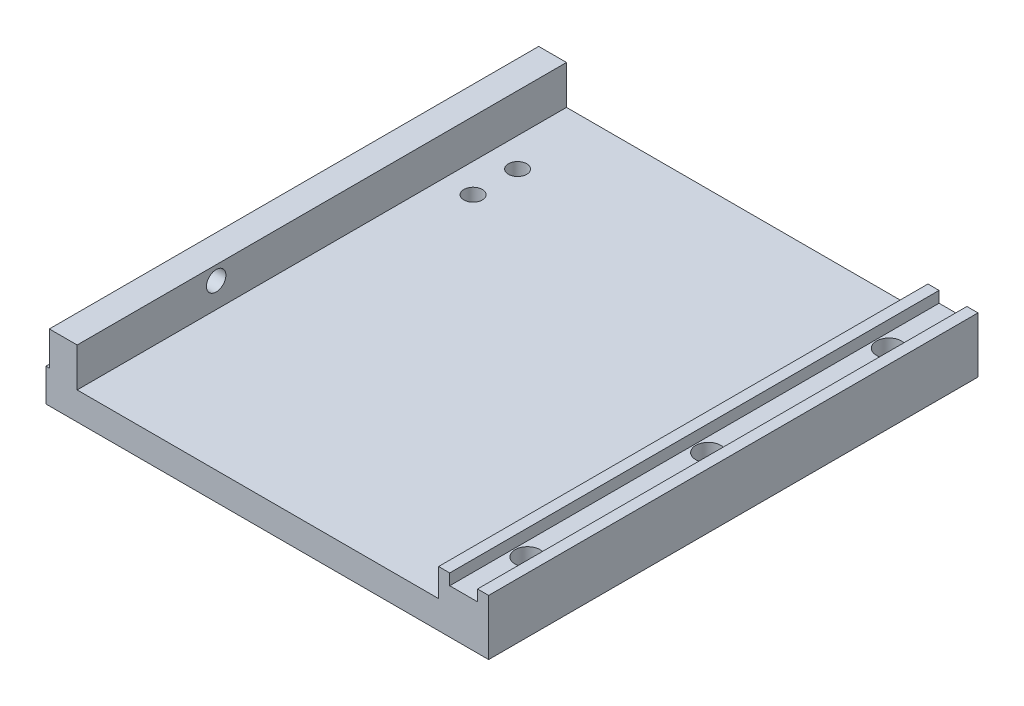
ISO-10303-21;
HEADER;
FILE_DESCRIPTION(('STEP AP214'),'2;1');
FILE_NAME('part.step','',(''),(''),'','','');
FILE_SCHEMA(('AUTOMOTIVE_DESIGN { 1 0 10303 214 1 1 1 1 }'));
ENDSEC;
DATA;
#1=APPLICATION_CONTEXT('core data for automotive mechanical design processes');
#2=APPLICATION_PROTOCOL_DEFINITION('international standard','automotive_design',2000,#1);
#3=PRODUCT_CONTEXT('',#1,'mechanical');
#4=PRODUCT('Part','Part','',(#3));
#5=PRODUCT_RELATED_PRODUCT_CATEGORY('part','',(#4));
#6=PRODUCT_DEFINITION_FORMATION('','',#4);
#7=PRODUCT_DEFINITION_CONTEXT('part definition',#1,'design');
#8=PRODUCT_DEFINITION('design','',#6,#7);
#9=PRODUCT_DEFINITION_SHAPE('','',#8);
#10=(LENGTH_UNIT() NAMED_UNIT(*) SI_UNIT(.MILLI.,.METRE.));
#11=(NAMED_UNIT(*) PLANE_ANGLE_UNIT() SI_UNIT($,.RADIAN.));
#12=(NAMED_UNIT(*) SI_UNIT($,.STERADIAN.) SOLID_ANGLE_UNIT());
#13=UNCERTAINTY_MEASURE_WITH_UNIT(LENGTH_MEASURE(1.E-05),#10,'distance_accuracy_value','');
#14=(GEOMETRIC_REPRESENTATION_CONTEXT(3) GLOBAL_UNCERTAINTY_ASSIGNED_CONTEXT((#13)) GLOBAL_UNIT_ASSIGNED_CONTEXT((#10,
#11,#12)) REPRESENTATION_CONTEXT('',''));
#15=CARTESIAN_POINT('',(0.,0.,0.));
#16=DIRECTION('',(0.,0.,1.));
#17=DIRECTION('',(1.,0.,0.));
#18=AXIS2_PLACEMENT_3D('',#15,#16,#17);
#19=CARTESIAN_POINT('',(-8.9999999999999,10.,88.));
#20=DIRECTION('',(0.,-1.,0.));
#21=DIRECTION('',(0.,0.,-1.));
#22=AXIS2_PLACEMENT_3D('',#19,#20,#21);
#23=PLANE('',#22);
#24=DIRECTION('',(-1.,0.,0.));
#25=VECTOR('',#24,1.);
#26=CARTESIAN_POINT('',(-8.9999999999999,10.,0.));
#27=LINE('',#26,#25);
#28=CARTESIAN_POINT('',(-7.00000000000012,10.,0.));
#29=VERTEX_POINT('',#28);
#30=CARTESIAN_POINT('',(-8.9999999999999,10.,0.));
#31=VERTEX_POINT('',#30);
#32=EDGE_CURVE('E176',#29,#31,#27,.T.);
#33=ORIENTED_EDGE('',*,*,#32,.T.);
#34=DIRECTION('',(0.,0.,-1.));
#35=VECTOR('',#34,1.);
#36=CARTESIAN_POINT('',(-8.9999999999999,10.,88.));
#37=LINE('',#36,#35);
#38=CARTESIAN_POINT('',(-8.9999999999999,10.,88.));
#39=VERTEX_POINT('',#38);
#40=EDGE_CURVE('E11',#39,#31,#37,.T.);
#41=ORIENTED_EDGE('',*,*,#40,.F.);
#42=DIRECTION('',(-1.,0.,0.));
#43=VECTOR('',#42,1.);
#44=CARTESIAN_POINT('',(-8.9999999999999,10.,88.));
#45=LINE('',#44,#43);
#46=CARTESIAN_POINT('',(-7.00000000000012,10.,88.));
#47=VERTEX_POINT('',#46);
#48=EDGE_CURVE('E203',#47,#39,#45,.T.);
#49=ORIENTED_EDGE('',*,*,#48,.F.);
#50=DIRECTION('',(0.,0.,-1.));
#51=VECTOR('',#50,1.);
#52=CARTESIAN_POINT('',(-7.00000000000012,10.,88.));
#53=LINE('',#52,#51);
#54=EDGE_CURVE('E172',#47,#29,#53,.T.);
#55=ORIENTED_EDGE('',*,*,#54,.T.);
#56=EDGE_LOOP('',(#33,#41,#49,#55));
#57=FACE_BOUND('',#56,.T.);
#58=ADVANCED_FACE('F39',(#57),#23,.F.);
#59=CARTESIAN_POINT('',(-8.9999999999999,10.,88.));
#60=DIRECTION('',(1.,0.,0.));
#61=DIRECTION('',(0.,0.,-1.));
#62=AXIS2_PLACEMENT_3D('',#59,#60,#61);
#63=PLANE('',#62);
#64=DIRECTION('',(0.,-1.,0.));
#65=VECTOR('',#64,1.);
#66=CARTESIAN_POINT('',(-8.9999999999999,10.,0.));
#67=LINE('',#66,#65);
#68=CARTESIAN_POINT('',(-8.9999999999999,5.,0.));
#69=VERTEX_POINT('',#68);
#70=EDGE_CURVE('E179',#31,#69,#67,.T.);
#71=ORIENTED_EDGE('',*,*,#70,.T.);
#72=DIRECTION('',(0.,0.,-1.));
#73=VECTOR('',#72,1.);
#74=CARTESIAN_POINT('',(-8.9999999999999,5.,88.));
#75=LINE('',#74,#73);
#76=CARTESIAN_POINT('',(-8.9999999999999,5.,88.));
#77=VERTEX_POINT('',#76);
#78=EDGE_CURVE('E48',#77,#69,#75,.T.);
#79=ORIENTED_EDGE('',*,*,#78,.F.);
#80=DIRECTION('',(0.,-1.,0.));
#81=VECTOR('',#80,1.);
#82=CARTESIAN_POINT('',(-8.9999999999999,10.,88.));
#83=LINE('',#82,#81);
#84=EDGE_CURVE('E119',#39,#77,#83,.T.);
#85=ORIENTED_EDGE('',*,*,#84,.F.);
#86=ORIENTED_EDGE('',*,*,#40,.T.);
#87=EDGE_LOOP('',(#71,#79,#85,#86));
#88=FACE_BOUND('',#87,.T.);
#89=ADVANCED_FACE('F305',(#88),#63,.F.);
#90=CARTESIAN_POINT('',(-8.9999999999999,5.,88.));
#91=DIRECTION('',(0.,-1.,0.));
#92=DIRECTION('',(0.,0.,-1.));
#93=AXIS2_PLACEMENT_3D('',#90,#91,#92);
#94=PLANE('',#93);
#95=CARTESIAN_POINT('',(-68.8,5.,14.));
#96=DIRECTION('',(0.,-1.,0.));
#97=DIRECTION('',(0.,0.,-1.));
#98=AXIS2_PLACEMENT_3D('',#95,#96,#97);
#99=CIRCLE('',#98,1.65);
#100=CARTESIAN_POINT('',(-68.8,5.,12.35));
#101=VERTEX_POINT('',#100);
#102=EDGE_CURVE('E617',#101,#101,#99,.T.);
#103=ORIENTED_EDGE('',*,*,#102,.T.);
#104=EDGE_LOOP('',(#103));
#105=FACE_BOUND('',#104,.T.);
#106=CARTESIAN_POINT('',(-68.8,5.,22.));
#107=DIRECTION('',(0.,-1.,0.));
#108=DIRECTION('',(0.,0.,-1.));
#109=AXIS2_PLACEMENT_3D('',#106,#107,#108);
#110=CIRCLE('',#109,1.65);
#111=CARTESIAN_POINT('',(-68.8,5.,20.35));
#112=VERTEX_POINT('',#111);
#113=EDGE_CURVE('E623',#112,#112,#110,.T.);
#114=ORIENTED_EDGE('',*,*,#113,.T.);
#115=EDGE_LOOP('',(#114));
#116=FACE_BOUND('',#115,.T.);
#117=DIRECTION('',(-1.,0.,0.));
#118=VECTOR('',#117,1.);
#119=CARTESIAN_POINT('',(-8.9999999999999,5.,0.));
#120=LINE('',#119,#118);
#121=CARTESIAN_POINT('',(-74.0000000000001,5.,0.));
#122=VERTEX_POINT('',#121);
#123=EDGE_CURVE('E182',#69,#122,#120,.T.);
#124=ORIENTED_EDGE('',*,*,#123,.T.);
#125=DIRECTION('',(0.,0.,-1.));
#126=VECTOR('',#125,1.);
#127=CARTESIAN_POINT('',(-74.0000000000001,5.,88.));
#128=LINE('',#127,#126);
#129=CARTESIAN_POINT('',(-74.0000000000001,5.,88.));
#130=VERTEX_POINT('',#129);
#131=EDGE_CURVE('E228',#130,#122,#128,.T.);
#132=ORIENTED_EDGE('',*,*,#131,.F.);
#133=DIRECTION('',(-1.,0.,0.));
#134=VECTOR('',#133,1.);
#135=CARTESIAN_POINT('',(-8.9999999999999,5.,88.));
#136=LINE('',#135,#134);
#137=EDGE_CURVE('E260',#77,#130,#136,.T.);
#138=ORIENTED_EDGE('',*,*,#137,.F.);
#139=ORIENTED_EDGE('',*,*,#78,.T.);
#140=EDGE_LOOP('',(#124,#132,#138,#139));
#141=FACE_BOUND('',#140,.T.);
#142=ADVANCED_FACE('F309',(#105,#116,#141),#94,.F.);
#143=CARTESIAN_POINT('',(-74.0000000000001,12.,88.));
#144=DIRECTION('',(-1.,0.,0.));
#145=DIRECTION('',(0.,0.,1.));
#146=AXIS2_PLACEMENT_3D('',#143,#144,#145);
#147=PLANE('',#146);
#148=CARTESIAN_POINT('',(-74.0000000000001,9.50000000000001,63.));
#149=DIRECTION('',(-1.,0.,0.));
#150=DIRECTION('',(0.,0.,1.));
#151=AXIS2_PLACEMENT_3D('',#148,#149,#150);
#152=CIRCLE('',#151,1.75);
#153=CARTESIAN_POINT('',(-74.0000000000001,9.50000000000001,64.75));
#154=VERTEX_POINT('',#153);
#155=EDGE_CURVE('E589',#154,#154,#152,.T.);
#156=ORIENTED_EDGE('',*,*,#155,.T.);
#157=EDGE_LOOP('',(#156));
#158=FACE_BOUND('',#157,.T.);
#159=DIRECTION('',(0.,1.,0.));
#160=VECTOR('',#159,1.);
#161=CARTESIAN_POINT('',(-74.0000000000001,12.,0.));
#162=LINE('',#161,#160);
#163=CARTESIAN_POINT('',(-74.0000000000001,12.,0.));
#164=VERTEX_POINT('',#163);
#165=EDGE_CURVE('E184',#122,#164,#162,.T.);
#166=ORIENTED_EDGE('',*,*,#165,.T.);
#167=DIRECTION('',(0.,0.,-1.));
#168=VECTOR('',#167,1.);
#169=CARTESIAN_POINT('',(-74.0000000000001,12.,88.));
#170=LINE('',#169,#168);
#171=CARTESIAN_POINT('',(-74.0000000000001,12.,88.));
#172=VERTEX_POINT('',#171);
#173=EDGE_CURVE('E225',#172,#164,#170,.T.);
#174=ORIENTED_EDGE('',*,*,#173,.F.);
#175=DIRECTION('',(0.,1.,0.));
#176=VECTOR('',#175,1.);
#177=CARTESIAN_POINT('',(-74.0000000000001,12.,88.));
#178=LINE('',#177,#176);
#179=EDGE_CURVE('E262',#130,#172,#178,.T.);
#180=ORIENTED_EDGE('',*,*,#179,.F.);
#181=ORIENTED_EDGE('',*,*,#131,.T.);
#182=EDGE_LOOP('',(#166,#174,#180,#181));
#183=FACE_BOUND('',#182,.T.);
#184=ADVANCED_FACE('F314',(#158,#183),#147,.F.);
#185=CARTESIAN_POINT('',(-74.0000000000001,12.,88.));
#186=DIRECTION('',(0.,-1.,0.));
#187=DIRECTION('',(0.,0.,-1.));
#188=AXIS2_PLACEMENT_3D('',#185,#186,#187);
#189=PLANE('',#188);
#190=DIRECTION('',(-1.,0.,0.));
#191=VECTOR('',#190,1.);
#192=CARTESIAN_POINT('',(-74.0000000000001,12.,0.));
#193=LINE('',#192,#191);
#194=CARTESIAN_POINT('',(-79.0000000000001,12.,0.));
#195=VERTEX_POINT('',#194);
#196=EDGE_CURVE('E186',#164,#195,#193,.T.);
#197=ORIENTED_EDGE('',*,*,#196,.T.);
#198=DIRECTION('',(0.,0.,-1.));
#199=VECTOR('',#198,1.);
#200=CARTESIAN_POINT('',(-79.0000000000001,12.,88.));
#201=LINE('',#200,#199);
#202=CARTESIAN_POINT('',(-79.0000000000001,12.,88.));
#203=VERTEX_POINT('',#202);
#204=EDGE_CURVE('E222',#203,#195,#201,.T.);
#205=ORIENTED_EDGE('',*,*,#204,.F.);
#206=DIRECTION('',(-1.,0.,0.));
#207=VECTOR('',#206,1.);
#208=CARTESIAN_POINT('',(-74.0000000000001,12.,88.));
#209=LINE('',#208,#207);
#210=EDGE_CURVE('E264',#172,#203,#209,.T.);
#211=ORIENTED_EDGE('',*,*,#210,.F.);
#212=ORIENTED_EDGE('',*,*,#173,.T.);
#213=EDGE_LOOP('',(#197,#205,#211,#212));
#214=FACE_BOUND('',#213,.T.);
#215=ADVANCED_FACE('F320',(#214),#189,.F.);
#216=CARTESIAN_POINT('',(-79.0000000000001,5.89999999999963,88.));
#217=DIRECTION('',(1.,0.,0.));
#218=DIRECTION('',(0.,0.,-1.));
#219=AXIS2_PLACEMENT_3D('',#216,#217,#218);
#220=PLANE('',#219);
#221=CARTESIAN_POINT('',(-79.0000000000001,9.50000000000001,63.));
#222=DIRECTION('',(-1.,0.,0.));
#223=DIRECTION('',(0.,0.,1.));
#224=AXIS2_PLACEMENT_3D('',#221,#222,#223);
#225=CIRCLE('',#224,1.75);
#226=CARTESIAN_POINT('',(-79.0000000000001,9.50000000000001,64.75));
#227=VERTEX_POINT('',#226);
#228=EDGE_CURVE('E592',#227,#227,#225,.T.);
#229=ORIENTED_EDGE('',*,*,#228,.F.);
#230=EDGE_LOOP('',(#229));
#231=FACE_BOUND('',#230,.T.);
#232=DIRECTION('',(0.,-1.,0.));
#233=VECTOR('',#232,1.);
#234=CARTESIAN_POINT('',(-79.0000000000001,5.89999999999963,0.));
#235=LINE('',#234,#233);
#236=CARTESIAN_POINT('',(-79.0000000000001,5.89999999999963,0.));
#237=VERTEX_POINT('',#236);
#238=EDGE_CURVE('E188',#195,#237,#235,.T.);
#239=ORIENTED_EDGE('',*,*,#238,.T.);
#240=DIRECTION('',(0.,0.,-1.));
#241=VECTOR('',#240,1.);
#242=CARTESIAN_POINT('',(-79.0000000000001,5.89999999999963,88.));
#243=LINE('',#242,#241);
#244=CARTESIAN_POINT('',(-79.0000000000001,5.89999999999963,88.));
#245=VERTEX_POINT('',#244);
#246=EDGE_CURVE('E219',#245,#237,#243,.T.);
#247=ORIENTED_EDGE('',*,*,#246,.F.);
#248=DIRECTION('',(0.,-1.,0.));
#249=VECTOR('',#248,1.);
#250=CARTESIAN_POINT('',(-79.0000000000001,5.89999999999963,88.));
#251=LINE('',#250,#249);
#252=EDGE_CURVE('E266',#203,#245,#251,.T.);
#253=ORIENTED_EDGE('',*,*,#252,.F.);
#254=ORIENTED_EDGE('',*,*,#204,.T.);
#255=EDGE_LOOP('',(#239,#247,#253,#254));
#256=FACE_BOUND('',#255,.T.);
#257=ADVANCED_FACE('F324',(#231,#256),#220,.F.);
#258=CARTESIAN_POINT('',(-79.5999999999986,5.89999999999963,88.));
#259=DIRECTION('',(0.,-1.,0.));
#260=DIRECTION('',(0.,0.,-1.));
#261=AXIS2_PLACEMENT_3D('',#258,#259,#260);
#262=PLANE('',#261);
#263=DIRECTION('',(-1.,0.,0.));
#264=VECTOR('',#263,1.);
#265=CARTESIAN_POINT('',(-79.5999999999986,5.89999999999963,0.));
#266=LINE('',#265,#264);
#267=CARTESIAN_POINT('',(-79.5999999999986,5.89999999999963,0.));
#268=VERTEX_POINT('',#267);
#269=EDGE_CURVE('E190',#237,#268,#266,.T.);
#270=ORIENTED_EDGE('',*,*,#269,.T.);
#271=DIRECTION('',(0.,0.,-1.));
#272=VECTOR('',#271,1.);
#273=CARTESIAN_POINT('',(-79.5999999999986,5.89999999999963,88.));
#274=LINE('',#273,#272);
#275=CARTESIAN_POINT('',(-79.5999999999986,5.89999999999963,88.));
#276=VERTEX_POINT('',#275);
#277=EDGE_CURVE('E216',#276,#268,#274,.T.);
#278=ORIENTED_EDGE('',*,*,#277,.F.);
#279=DIRECTION('',(-1.,0.,0.));
#280=VECTOR('',#279,1.);
#281=CARTESIAN_POINT('',(-79.5999999999986,5.89999999999963,88.));
#282=LINE('',#281,#280);
#283=EDGE_CURVE('E268',#245,#276,#282,.T.);
#284=ORIENTED_EDGE('',*,*,#283,.F.);
#285=ORIENTED_EDGE('',*,*,#246,.T.);
#286=EDGE_LOOP('',(#270,#278,#284,#285));
#287=FACE_BOUND('',#286,.T.);
#288=ADVANCED_FACE('F328',(#287),#262,.F.);
#289=CARTESIAN_POINT('',(-79.5999999999986,0.,88.));
#290=DIRECTION('',(1.,0.,0.));
#291=DIRECTION('',(0.,0.,-1.));
#292=AXIS2_PLACEMENT_3D('',#289,#290,#291);
#293=PLANE('',#292);
#294=CARTESIAN_POINT('',(-79.5999999999986,3.,11.5));
#295=DIRECTION('',(-1.,0.,0.));
#296=DIRECTION('',(0.,0.,1.));
#297=AXIS2_PLACEMENT_3D('',#294,#295,#296);
#298=CIRCLE('',#297,1.24999999999999);
#299=CARTESIAN_POINT('',(-79.5999999999986,3.,12.75));
#300=VERTEX_POINT('',#299);
#301=EDGE_CURVE('E594',#300,#300,#298,.T.);
#302=ORIENTED_EDGE('',*,*,#301,.F.);
#303=EDGE_LOOP('',(#302));
#304=FACE_BOUND('',#303,.T.);
#305=CARTESIAN_POINT('',(-79.5999999999986,3.,44.));
#306=DIRECTION('',(-1.,0.,0.));
#307=DIRECTION('',(0.,0.,1.));
#308=AXIS2_PLACEMENT_3D('',#305,#306,#307);
#309=CIRCLE('',#308,1.24999999999999);
#310=CARTESIAN_POINT('',(-79.5999999999986,3.,45.25));
#311=VERTEX_POINT('',#310);
#312=EDGE_CURVE('E602',#311,#311,#309,.T.);
#313=ORIENTED_EDGE('',*,*,#312,.F.);
#314=EDGE_LOOP('',(#313));
#315=FACE_BOUND('',#314,.T.);
#316=CARTESIAN_POINT('',(-79.5999999999986,3.00000000000001,76.5));
#317=DIRECTION('',(-1.,0.,0.));
#318=DIRECTION('',(0.,0.,1.));
#319=AXIS2_PLACEMENT_3D('',#316,#317,#318);
#320=CIRCLE('',#319,1.24999999999999);
#321=CARTESIAN_POINT('',(-79.5999999999986,3.00000000000001,77.75));
#322=VERTEX_POINT('',#321);
#323=EDGE_CURVE('E608',#322,#322,#320,.T.);
#324=ORIENTED_EDGE('',*,*,#323,.F.);
#325=EDGE_LOOP('',(#324));
#326=FACE_BOUND('',#325,.T.);
#327=DIRECTION('',(0.,-1.,0.));
#328=VECTOR('',#327,1.);
#329=CARTESIAN_POINT('',(-79.5999999999986,0.,0.));
#330=LINE('',#329,#328);
#331=CARTESIAN_POINT('',(-79.5999999999986,0.,0.));
#332=VERTEX_POINT('',#331);
#333=EDGE_CURVE('E192',#268,#332,#330,.T.);
#334=ORIENTED_EDGE('',*,*,#333,.T.);
#335=DIRECTION('',(0.,0.,-1.));
#336=VECTOR('',#335,1.);
#337=CARTESIAN_POINT('',(-79.5999999999986,0.,88.));
#338=LINE('',#337,#336);
#339=CARTESIAN_POINT('',(-79.5999999999986,0.,88.));
#340=VERTEX_POINT('',#339);
#341=EDGE_CURVE('E213',#340,#332,#338,.T.);
#342=ORIENTED_EDGE('',*,*,#341,.F.);
#343=DIRECTION('',(0.,-1.,0.));
#344=VECTOR('',#343,1.);
#345=CARTESIAN_POINT('',(-79.5999999999986,0.,88.));
#346=LINE('',#345,#344);
#347=EDGE_CURVE('E270',#276,#340,#346,.T.);
#348=ORIENTED_EDGE('',*,*,#347,.F.);
#349=ORIENTED_EDGE('',*,*,#277,.T.);
#350=EDGE_LOOP('',(#334,#342,#348,#349));
#351=FACE_BOUND('',#350,.T.);
#352=ADVANCED_FACE('F332',(#304,#315,#326,#351),#293,.F.);
#353=CARTESIAN_POINT('',(0.,0.,88.));
#354=DIRECTION('',(0.,1.,0.));
#355=DIRECTION('',(0.,0.,1.));
#356=AXIS2_PLACEMENT_3D('',#353,#354,#355);
#357=PLANE('',#356);
#358=CARTESIAN_POINT('',(-68.8,0.,14.));
#359=DIRECTION('',(0.,-1.,0.));
#360=DIRECTION('',(0.,0.,-1.));
#361=AXIS2_PLACEMENT_3D('',#358,#359,#360);
#362=CIRCLE('',#361,1.65);
#363=CARTESIAN_POINT('',(-68.8,0.,12.35));
#364=VERTEX_POINT('',#363);
#365=EDGE_CURVE('E614',#364,#364,#362,.T.);
#366=ORIENTED_EDGE('',*,*,#365,.F.);
#367=EDGE_LOOP('',(#366));
#368=FACE_BOUND('',#367,.T.);
#369=CARTESIAN_POINT('',(-68.8,0.,22.));
#370=DIRECTION('',(0.,-1.,0.));
#371=DIRECTION('',(0.,0.,-1.));
#372=AXIS2_PLACEMENT_3D('',#369,#370,#371);
#373=CIRCLE('',#372,1.65);
#374=CARTESIAN_POINT('',(-68.8,0.,20.35));
#375=VERTEX_POINT('',#374);
#376=EDGE_CURVE('E620',#375,#375,#373,.T.);
#377=ORIENTED_EDGE('',*,*,#376,.F.);
#378=EDGE_LOOP('',(#377));
#379=FACE_BOUND('',#378,.T.);
#380=CARTESIAN_POINT('',(-4.5,0.,11.5));
#381=DIRECTION('',(0.,-1.,0.));
#382=DIRECTION('',(0.,0.,-1.));
#383=AXIS2_PLACEMENT_3D('',#380,#381,#382);
#384=CIRCLE('',#383,3.99999999999999);
#385=CARTESIAN_POINT('',(-4.5,0.,7.5));
#386=VERTEX_POINT('',#385);
#387=EDGE_CURVE('E626',#386,#386,#384,.T.);
#388=ORIENTED_EDGE('',*,*,#387,.F.);
#389=EDGE_LOOP('',(#388));
#390=FACE_BOUND('',#389,.T.);
#391=CARTESIAN_POINT('',(-4.50000000000001,0.,44.));
#392=DIRECTION('',(0.,-1.,0.));
#393=DIRECTION('',(0.,0.,-1.));
#394=AXIS2_PLACEMENT_3D('',#391,#392,#393);
#395=CIRCLE('',#394,3.99999999999999);
#396=CARTESIAN_POINT('',(-4.50000000000001,0.,40.));
#397=VERTEX_POINT('',#396);
#398=EDGE_CURVE('E250',#397,#397,#395,.T.);
#399=ORIENTED_EDGE('',*,*,#398,.F.);
#400=EDGE_LOOP('',(#399));
#401=FACE_BOUND('',#400,.T.);
#402=CARTESIAN_POINT('',(-4.50000000000001,0.,76.5));
#403=DIRECTION('',(0.,-1.,0.));
#404=DIRECTION('',(0.,0.,-1.));
#405=AXIS2_PLACEMENT_3D('',#402,#403,#404);
#406=CIRCLE('',#405,3.99999999999999);
#407=CARTESIAN_POINT('',(-4.50000000000001,0.,72.5));
#408=VERTEX_POINT('',#407);
#409=EDGE_CURVE('E237',#408,#408,#406,.T.);
#410=ORIENTED_EDGE('',*,*,#409,.F.);
#411=EDGE_LOOP('',(#410));
#412=FACE_BOUND('',#411,.T.);
#413=DIRECTION('',(1.,0.,0.));
#414=VECTOR('',#413,1.);
#415=CARTESIAN_POINT('',(0.,0.,0.));
#416=LINE('',#415,#414);
#417=CARTESIAN_POINT('',(0.,0.,0.));
#418=VERTEX_POINT('',#417);
#419=EDGE_CURVE('E194',#332,#418,#416,.T.);
#420=ORIENTED_EDGE('',*,*,#419,.T.);
#421=DIRECTION('',(0.,0.,-1.));
#422=VECTOR('',#421,1.);
#423=CARTESIAN_POINT('',(0.,0.,88.));
#424=LINE('',#423,#422);
#425=CARTESIAN_POINT('',(0.,0.,88.));
#426=VERTEX_POINT('',#425);
#427=EDGE_CURVE('E210',#426,#418,#424,.T.);
#428=ORIENTED_EDGE('',*,*,#427,.F.);
#429=DIRECTION('',(1.,0.,0.));
#430=VECTOR('',#429,1.);
#431=CARTESIAN_POINT('',(0.,0.,88.));
#432=LINE('',#431,#430);
#433=EDGE_CURVE('E272',#340,#426,#432,.T.);
#434=ORIENTED_EDGE('',*,*,#433,.F.);
#435=ORIENTED_EDGE('',*,*,#341,.T.);
#436=EDGE_LOOP('',(#420,#428,#434,#435));
#437=FACE_BOUND('',#436,.T.);
#438=ADVANCED_FACE('F336',(#368,#379,#390,#401,#412,#437),#357,.F.);
#439=CARTESIAN_POINT('',(0.,10.,88.));
#440=DIRECTION('',(-1.,0.,0.));
#441=DIRECTION('',(0.,0.,1.));
#442=AXIS2_PLACEMENT_3D('',#439,#440,#441);
#443=PLANE('',#442);
#444=DIRECTION('',(0.,1.,0.));
#445=VECTOR('',#444,1.);
#446=CARTESIAN_POINT('',(0.,10.,0.));
#447=LINE('',#446,#445);
#448=CARTESIAN_POINT('',(0.,10.,0.));
#449=VERTEX_POINT('',#448);
#450=EDGE_CURVE('E196',#418,#449,#447,.T.);
#451=ORIENTED_EDGE('',*,*,#450,.T.);
#452=DIRECTION('',(0.,0.,-1.));
#453=VECTOR('',#452,1.);
#454=CARTESIAN_POINT('',(0.,10.,88.));
#455=LINE('',#454,#453);
#456=CARTESIAN_POINT('',(0.,10.,88.));
#457=VERTEX_POINT('',#456);
#458=EDGE_CURVE('E207',#457,#449,#455,.T.);
#459=ORIENTED_EDGE('',*,*,#458,.F.);
#460=DIRECTION('',(0.,1.,0.));
#461=VECTOR('',#460,1.);
#462=CARTESIAN_POINT('',(0.,10.,88.));
#463=LINE('',#462,#461);
#464=EDGE_CURVE('E274',#426,#457,#463,.T.);
#465=ORIENTED_EDGE('',*,*,#464,.F.);
#466=ORIENTED_EDGE('',*,*,#427,.T.);
#467=EDGE_LOOP('',(#451,#459,#465,#466));
#468=FACE_BOUND('',#467,.T.);
#469=ADVANCED_FACE('F280',(#468),#443,.F.);
#470=CARTESIAN_POINT('',(-2.,10.,88.));
#471=DIRECTION('',(0.,-1.,0.));
#472=DIRECTION('',(0.,0.,-1.));
#473=AXIS2_PLACEMENT_3D('',#470,#471,#472);
#474=PLANE('',#473);
#475=DIRECTION('',(-1.,0.,0.));
#476=VECTOR('',#475,1.);
#477=CARTESIAN_POINT('',(-2.,10.,0.));
#478=LINE('',#477,#476);
#479=CARTESIAN_POINT('',(-2.,10.,0.));
#480=VERTEX_POINT('',#479);
#481=EDGE_CURVE('E198',#449,#480,#478,.T.);
#482=ORIENTED_EDGE('',*,*,#481,.T.);
#483=DIRECTION('',(0.,0.,-1.));
#484=VECTOR('',#483,1.);
#485=CARTESIAN_POINT('',(-2.,10.,88.));
#486=LINE('',#485,#484);
#487=CARTESIAN_POINT('',(-2.,10.,88.));
#488=VERTEX_POINT('',#487);
#489=EDGE_CURVE('E167',#488,#480,#486,.T.);
#490=ORIENTED_EDGE('',*,*,#489,.F.);
#491=DIRECTION('',(-1.,0.,0.));
#492=VECTOR('',#491,1.);
#493=CARTESIAN_POINT('',(-2.,10.,88.));
#494=LINE('',#493,#492);
#495=EDGE_CURVE('E158',#457,#488,#494,.T.);
#496=ORIENTED_EDGE('',*,*,#495,.F.);
#497=ORIENTED_EDGE('',*,*,#458,.T.);
#498=EDGE_LOOP('',(#482,#490,#496,#497));
#499=FACE_BOUND('',#498,.T.);
#500=ADVANCED_FACE('F284',(#499),#474,.F.);
#501=CARTESIAN_POINT('',(-2.,8.00000000000001,88.));
#502=DIRECTION('',(1.,0.,0.));
#503=DIRECTION('',(0.,0.,-1.));
#504=AXIS2_PLACEMENT_3D('',#501,#502,#503);
#505=PLANE('',#504);
#506=DIRECTION('',(0.,-1.,0.));
#507=VECTOR('',#506,1.);
#508=CARTESIAN_POINT('',(-2.,8.00000000000001,0.));
#509=LINE('',#508,#507);
#510=CARTESIAN_POINT('',(-2.,8.00000000000001,0.));
#511=VERTEX_POINT('',#510);
#512=EDGE_CURVE('E166',#480,#511,#509,.T.);
#513=ORIENTED_EDGE('',*,*,#512,.T.);
#514=DIRECTION('',(0.,0.,-1.));
#515=VECTOR('',#514,1.);
#516=CARTESIAN_POINT('',(-2.,8.00000000000001,88.));
#517=LINE('',#516,#515);
#518=CARTESIAN_POINT('',(-2.,8.00000000000001,88.));
#519=VERTEX_POINT('',#518);
#520=EDGE_CURVE('E163',#519,#511,#517,.T.);
#521=ORIENTED_EDGE('',*,*,#520,.F.);
#522=DIRECTION('',(0.,-1.,0.));
#523=VECTOR('',#522,1.);
#524=CARTESIAN_POINT('',(-2.,8.00000000000001,88.));
#525=LINE('',#524,#523);
#526=EDGE_CURVE('E152',#488,#519,#525,.T.);
#527=ORIENTED_EDGE('',*,*,#526,.F.);
#528=ORIENTED_EDGE('',*,*,#489,.T.);
#529=EDGE_LOOP('',(#513,#521,#527,#528));
#530=FACE_BOUND('',#529,.T.);
#531=ADVANCED_FACE('F164',(#530),#505,.F.);
#532=CARTESIAN_POINT('',(-7.00000000000012,8.00000000000001,88.));
#533=DIRECTION('',(0.,-1.,0.));
#534=DIRECTION('',(0.,0.,-1.));
#535=AXIS2_PLACEMENT_3D('',#532,#533,#534);
#536=PLANE('',#535);
#537=CARTESIAN_POINT('',(-4.5,8.00000000000001,11.5));
#538=DIRECTION('',(0.,-1.,0.));
#539=DIRECTION('',(0.,0.,-1.));
#540=AXIS2_PLACEMENT_3D('',#537,#538,#539);
#541=CIRCLE('',#540,2.25);
#542=CARTESIAN_POINT('',(-4.5,8.00000000000001,9.25));
#543=VERTEX_POINT('',#542);
#544=EDGE_CURVE('E42',#543,#543,#541,.T.);
#545=ORIENTED_EDGE('',*,*,#544,.T.);
#546=EDGE_LOOP('',(#545));
#547=FACE_BOUND('',#546,.T.);
#548=CARTESIAN_POINT('',(-4.50000000000001,8.00000000000001,44.));
#549=DIRECTION('',(0.,-1.,0.));
#550=DIRECTION('',(0.,0.,-1.));
#551=AXIS2_PLACEMENT_3D('',#548,#549,#550);
#552=CIRCLE('',#551,2.25);
#553=CARTESIAN_POINT('',(-4.50000000000001,8.00000000000001,41.75));
#554=VERTEX_POINT('',#553);
#555=EDGE_CURVE('E235',#554,#554,#552,.T.);
#556=ORIENTED_EDGE('',*,*,#555,.T.);
#557=EDGE_LOOP('',(#556));
#558=FACE_BOUND('',#557,.T.);
#559=CARTESIAN_POINT('',(-4.50000000000001,8.00000000000001,76.5));
#560=DIRECTION('',(0.,-1.,0.));
#561=DIRECTION('',(0.,0.,-1.));
#562=AXIS2_PLACEMENT_3D('',#559,#560,#561);
#563=CIRCLE('',#562,2.25);
#564=CARTESIAN_POINT('',(-4.50000000000001,8.00000000000001,74.25));
#565=VERTEX_POINT('',#564);
#566=EDGE_CURVE('E180',#565,#565,#563,.T.);
#567=ORIENTED_EDGE('',*,*,#566,.T.);
#568=EDGE_LOOP('',(#567));
#569=FACE_BOUND('',#568,.T.);
#570=DIRECTION('',(-1.,0.,0.));
#571=VECTOR('',#570,1.);
#572=CARTESIAN_POINT('',(-7.00000000000012,8.00000000000001,0.));
#573=LINE('',#572,#571);
#574=CARTESIAN_POINT('',(-7.00000000000012,8.00000000000001,0.));
#575=VERTEX_POINT('',#574);
#576=EDGE_CURVE('E105',#511,#575,#573,.T.);
#577=ORIENTED_EDGE('',*,*,#576,.T.);
#578=DIRECTION('',(0.,0.,-1.));
#579=VECTOR('',#578,1.);
#580=CARTESIAN_POINT('',(-7.00000000000012,8.00000000000001,88.));
#581=LINE('',#580,#579);
#582=CARTESIAN_POINT('',(-7.00000000000012,8.00000000000001,88.));
#583=VERTEX_POINT('',#582);
#584=EDGE_CURVE('E168',#583,#575,#581,.T.);
#585=ORIENTED_EDGE('',*,*,#584,.F.);
#586=DIRECTION('',(-1.,0.,0.));
#587=VECTOR('',#586,1.);
#588=CARTESIAN_POINT('',(-7.00000000000012,8.00000000000001,88.));
#589=LINE('',#588,#587);
#590=EDGE_CURVE('E156',#519,#583,#589,.T.);
#591=ORIENTED_EDGE('',*,*,#590,.F.);
#592=ORIENTED_EDGE('',*,*,#520,.T.);
#593=EDGE_LOOP('',(#577,#585,#591,#592));
#594=FACE_BOUND('',#593,.T.);
#595=ADVANCED_FACE('F170',(#547,#558,#569,#594),#536,.F.);
#596=CARTESIAN_POINT('',(-7.00000000000012,10.,88.));
#597=DIRECTION('',(-1.,0.,0.));
#598=DIRECTION('',(0.,0.,1.));
#599=AXIS2_PLACEMENT_3D('',#596,#597,#598);
#600=PLANE('',#599);
#601=DIRECTION('',(0.,1.,0.));
#602=VECTOR('',#601,1.);
#603=CARTESIAN_POINT('',(-7.00000000000012,10.,0.));
#604=LINE('',#603,#602);
#605=EDGE_CURVE('E111',#575,#29,#604,.T.);
#606=ORIENTED_EDGE('',*,*,#605,.T.);
#607=ORIENTED_EDGE('',*,*,#54,.F.);
#608=DIRECTION('',(0.,1.,0.));
#609=VECTOR('',#608,1.);
#610=CARTESIAN_POINT('',(-7.00000000000012,10.,88.));
#611=LINE('',#610,#609);
#612=EDGE_CURVE('E57',#583,#47,#611,.T.);
#613=ORIENTED_EDGE('',*,*,#612,.F.);
#614=ORIENTED_EDGE('',*,*,#584,.T.);
#615=EDGE_LOOP('',(#606,#607,#613,#614));
#616=FACE_BOUND('',#615,.T.);
#617=ADVANCED_FACE('F292',(#616),#600,.F.);
#618=CARTESIAN_POINT('',(0.,0.,88.));
#619=DIRECTION('',(0.,0.,-1.));
#620=DIRECTION('',(-1.,0.,0.));
#621=AXIS2_PLACEMENT_3D('',#618,#619,#620);
#622=PLANE('',#621);
#623=ORIENTED_EDGE('',*,*,#48,.T.);
#624=ORIENTED_EDGE('',*,*,#84,.T.);
#625=ORIENTED_EDGE('',*,*,#137,.T.);
#626=ORIENTED_EDGE('',*,*,#179,.T.);
#627=ORIENTED_EDGE('',*,*,#210,.T.);
#628=ORIENTED_EDGE('',*,*,#252,.T.);
#629=ORIENTED_EDGE('',*,*,#283,.T.);
#630=ORIENTED_EDGE('',*,*,#347,.T.);
#631=ORIENTED_EDGE('',*,*,#433,.T.);
#632=ORIENTED_EDGE('',*,*,#464,.T.);
#633=ORIENTED_EDGE('',*,*,#495,.T.);
#634=ORIENTED_EDGE('',*,*,#526,.T.);
#635=ORIENTED_EDGE('',*,*,#590,.T.);
#636=ORIENTED_EDGE('',*,*,#612,.T.);
#637=EDGE_LOOP('',(#623,#624,#625,#626,#627,#628,#629,#630,#631,#632,#633,#634,#635,#636));
#638=FACE_BOUND('',#637,.T.);
#639=ADVANCED_FACE('F154',(#638),#622,.F.);
#640=CARTESIAN_POINT('',(0.,0.,0.));
#641=DIRECTION('',(0.,0.,-1.));
#642=DIRECTION('',(-1.,0.,0.));
#643=AXIS2_PLACEMENT_3D('',#640,#641,#642);
#644=PLANE('',#643);
#645=ORIENTED_EDGE('',*,*,#32,.F.);
#646=ORIENTED_EDGE('',*,*,#605,.F.);
#647=ORIENTED_EDGE('',*,*,#576,.F.);
#648=ORIENTED_EDGE('',*,*,#512,.F.);
#649=ORIENTED_EDGE('',*,*,#481,.F.);
#650=ORIENTED_EDGE('',*,*,#450,.F.);
#651=ORIENTED_EDGE('',*,*,#419,.F.);
#652=ORIENTED_EDGE('',*,*,#333,.F.);
#653=ORIENTED_EDGE('',*,*,#269,.F.);
#654=ORIENTED_EDGE('',*,*,#238,.F.);
#655=ORIENTED_EDGE('',*,*,#196,.F.);
#656=ORIENTED_EDGE('',*,*,#165,.F.);
#657=ORIENTED_EDGE('',*,*,#123,.F.);
#658=ORIENTED_EDGE('',*,*,#70,.F.);
#659=EDGE_LOOP('',(#645,#646,#647,#648,#649,#650,#651,#652,#653,#654,#655,#656,#657,#658));
#660=FACE_BOUND('',#659,.T.);
#661=ADVANCED_FACE('F287',(#660),#644,.T.);
#662=CARTESIAN_POINT('',(-4.50000000000001,0.,76.5));
#663=DIRECTION('',(0.,-1.,0.));
#664=DIRECTION('',(0.,0.,-1.));
#665=AXIS2_PLACEMENT_3D('',#662,#663,#664);
#666=CYLINDRICAL_SURFACE('',#665,2.25);
#667=CARTESIAN_POINT('',(-4.50000000000001,4.4,76.5));
#668=DIRECTION('',(0.,-1.,0.));
#669=DIRECTION('',(0.,0.,-1.));
#670=AXIS2_PLACEMENT_3D('',#667,#668,#669);
#671=CIRCLE('',#670,2.25);
#672=CARTESIAN_POINT('',(-4.50000000000001,4.4,74.25));
#673=VERTEX_POINT('',#672);
#674=EDGE_CURVE('E234',#673,#673,#671,.T.);
#675=ORIENTED_EDGE('',*,*,#674,.T.);
#676=EDGE_LOOP('',(#675));
#677=FACE_BOUND('',#676,.T.);
#678=ORIENTED_EDGE('',*,*,#566,.F.);
#679=EDGE_LOOP('',(#678));
#680=FACE_BOUND('',#679,.T.);
#681=ADVANCED_FACE('F364',(#677,#680),#666,.F.);
#682=CARTESIAN_POINT('',(-2.25000000000001,4.4,76.5));
#683=DIRECTION('',(0.,1.,0.));
#684=DIRECTION('',(0.,0.,1.));
#685=AXIS2_PLACEMENT_3D('',#682,#683,#684);
#686=PLANE('',#685);
#687=ORIENTED_EDGE('',*,*,#674,.F.);
#688=EDGE_LOOP('',(#687));
#689=FACE_BOUND('',#688,.T.);
#690=CARTESIAN_POINT('',(-4.50000000000001,4.4,76.5));
#691=DIRECTION('',(0.,-1.,0.));
#692=DIRECTION('',(0.,0.,-1.));
#693=AXIS2_PLACEMENT_3D('',#690,#691,#692);
#694=CIRCLE('',#693,4.);
#695=CARTESIAN_POINT('',(-4.50000000000001,4.4,72.5));
#696=VERTEX_POINT('',#695);
#697=EDGE_CURVE('E242',#696,#696,#694,.T.);
#698=ORIENTED_EDGE('',*,*,#697,.T.);
#699=EDGE_LOOP('',(#698));
#700=FACE_BOUND('',#699,.T.);
#701=ADVANCED_FACE('F369',(#689,#700),#686,.F.);
#702=CARTESIAN_POINT('',(-4.50000000000001,0.,76.5));
#703=DIRECTION('',(0.,-1.,0.));
#704=DIRECTION('',(0.,0.,-1.));
#705=AXIS2_PLACEMENT_3D('',#702,#703,#704);
#706=CYLINDRICAL_SURFACE('',#705,3.99999999999999);
#707=ORIENTED_EDGE('',*,*,#697,.F.);
#708=EDGE_LOOP('',(#707));
#709=FACE_BOUND('',#708,.T.);
#710=ORIENTED_EDGE('',*,*,#409,.T.);
#711=EDGE_LOOP('',(#710));
#712=FACE_BOUND('',#711,.T.);
#713=ADVANCED_FACE('F379',(#709,#712),#706,.F.);
#714=CARTESIAN_POINT('',(-4.50000000000001,0.,44.));
#715=DIRECTION('',(0.,-1.,0.));
#716=DIRECTION('',(0.,0.,-1.));
#717=AXIS2_PLACEMENT_3D('',#714,#715,#716);
#718=CYLINDRICAL_SURFACE('',#717,2.25);
#719=CARTESIAN_POINT('',(-4.50000000000001,4.4,44.));
#720=DIRECTION('',(0.,-1.,0.));
#721=DIRECTION('',(0.,0.,-1.));
#722=AXIS2_PLACEMENT_3D('',#719,#720,#721);
#723=CIRCLE('',#722,2.25);
#724=CARTESIAN_POINT('',(-4.50000000000001,4.4,41.75));
#725=VERTEX_POINT('',#724);
#726=EDGE_CURVE('E238',#725,#725,#723,.T.);
#727=ORIENTED_EDGE('',*,*,#726,.T.);
#728=EDGE_LOOP('',(#727));
#729=FACE_BOUND('',#728,.T.);
#730=ORIENTED_EDGE('',*,*,#555,.F.);
#731=EDGE_LOOP('',(#730));
#732=FACE_BOUND('',#731,.T.);
#733=ADVANCED_FACE('F389',(#729,#732),#718,.F.);
#734=CARTESIAN_POINT('',(-2.25000000000001,4.4,44.));
#735=DIRECTION('',(0.,1.,0.));
#736=DIRECTION('',(0.,0.,1.));
#737=AXIS2_PLACEMENT_3D('',#734,#735,#736);
#738=PLANE('',#737);
#739=ORIENTED_EDGE('',*,*,#726,.F.);
#740=EDGE_LOOP('',(#739));
#741=FACE_BOUND('',#740,.T.);
#742=CARTESIAN_POINT('',(-4.50000000000001,4.4,44.));
#743=DIRECTION('',(0.,-1.,0.));
#744=DIRECTION('',(0.,0.,-1.));
#745=AXIS2_PLACEMENT_3D('',#742,#743,#744);
#746=CIRCLE('',#745,4.);
#747=CARTESIAN_POINT('',(-4.50000000000001,4.4,40.));
#748=VERTEX_POINT('',#747);
#749=EDGE_CURVE('E245',#748,#748,#746,.T.);
#750=ORIENTED_EDGE('',*,*,#749,.T.);
#751=EDGE_LOOP('',(#750));
#752=FACE_BOUND('',#751,.T.);
#753=ADVANCED_FACE('F399',(#741,#752),#738,.F.);
#754=CARTESIAN_POINT('',(-4.50000000000001,0.,44.));
#755=DIRECTION('',(0.,-1.,0.));
#756=DIRECTION('',(0.,0.,-1.));
#757=AXIS2_PLACEMENT_3D('',#754,#755,#756);
#758=CYLINDRICAL_SURFACE('',#757,3.99999999999999);
#759=ORIENTED_EDGE('',*,*,#749,.F.);
#760=EDGE_LOOP('',(#759));
#761=FACE_BOUND('',#760,.T.);
#762=ORIENTED_EDGE('',*,*,#398,.T.);
#763=EDGE_LOOP('',(#762));
#764=FACE_BOUND('',#763,.T.);
#765=ADVANCED_FACE('F408',(#761,#764),#758,.F.);
#766=CARTESIAN_POINT('',(-4.5,0.,11.5));
#767=DIRECTION('',(0.,-1.,0.));
#768=DIRECTION('',(0.,0.,-1.));
#769=AXIS2_PLACEMENT_3D('',#766,#767,#768);
#770=CYLINDRICAL_SURFACE('',#769,2.25);
#771=CARTESIAN_POINT('',(-4.5,4.4,11.5));
#772=DIRECTION('',(0.,-1.,0.));
#773=DIRECTION('',(0.,0.,-1.));
#774=AXIS2_PLACEMENT_3D('',#771,#772,#773);
#775=CIRCLE('',#774,2.25);
#776=CARTESIAN_POINT('',(-4.5,4.4,9.25));
#777=VERTEX_POINT('',#776);
#778=EDGE_CURVE('E632',#777,#777,#775,.T.);
#779=ORIENTED_EDGE('',*,*,#778,.T.);
#780=EDGE_LOOP('',(#779));
#781=FACE_BOUND('',#780,.T.);
#782=ORIENTED_EDGE('',*,*,#544,.F.);
#783=EDGE_LOOP('',(#782));
#784=FACE_BOUND('',#783,.T.);
#785=ADVANCED_FACE('F418',(#781,#784),#770,.F.);
#786=CARTESIAN_POINT('',(-2.25,4.4,11.5));
#787=DIRECTION('',(0.,1.,0.));
#788=DIRECTION('',(0.,0.,1.));
#789=AXIS2_PLACEMENT_3D('',#786,#787,#788);
#790=PLANE('',#789);
#791=ORIENTED_EDGE('',*,*,#778,.F.);
#792=EDGE_LOOP('',(#791));
#793=FACE_BOUND('',#792,.T.);
#794=CARTESIAN_POINT('',(-4.5,4.4,11.5));
#795=DIRECTION('',(0.,-1.,0.));
#796=DIRECTION('',(0.,0.,-1.));
#797=AXIS2_PLACEMENT_3D('',#794,#795,#796);
#798=CIRCLE('',#797,4.);
#799=CARTESIAN_POINT('',(-4.5,4.4,7.5));
#800=VERTEX_POINT('',#799);
#801=EDGE_CURVE('E629',#800,#800,#798,.T.);
#802=ORIENTED_EDGE('',*,*,#801,.T.);
#803=EDGE_LOOP('',(#802));
#804=FACE_BOUND('',#803,.T.);
#805=ADVANCED_FACE('F428',(#793,#804),#790,.F.);
#806=CARTESIAN_POINT('',(-4.5,0.,11.5));
#807=DIRECTION('',(0.,-1.,0.));
#808=DIRECTION('',(0.,0.,-1.));
#809=AXIS2_PLACEMENT_3D('',#806,#807,#808);
#810=CYLINDRICAL_SURFACE('',#809,3.99999999999999);
#811=ORIENTED_EDGE('',*,*,#801,.F.);
#812=EDGE_LOOP('',(#811));
#813=FACE_BOUND('',#812,.T.);
#814=ORIENTED_EDGE('',*,*,#387,.T.);
#815=EDGE_LOOP('',(#814));
#816=FACE_BOUND('',#815,.T.);
#817=ADVANCED_FACE('F438',(#813,#816),#810,.F.);
#818=CARTESIAN_POINT('',(-68.8,0.,22.));
#819=DIRECTION('',(0.,-1.,0.));
#820=DIRECTION('',(0.,0.,-1.));
#821=AXIS2_PLACEMENT_3D('',#818,#819,#820);
#822=CYLINDRICAL_SURFACE('',#821,1.65);
#823=ORIENTED_EDGE('',*,*,#376,.T.);
#824=EDGE_LOOP('',(#823));
#825=FACE_BOUND('',#824,.T.);
#826=ORIENTED_EDGE('',*,*,#113,.F.);
#827=EDGE_LOOP('',(#826));
#828=FACE_BOUND('',#827,.T.);
#829=ADVANCED_FACE('F447',(#825,#828),#822,.F.);
#830=CARTESIAN_POINT('',(-68.8,0.,14.));
#831=DIRECTION('',(0.,-1.,0.));
#832=DIRECTION('',(0.,0.,-1.));
#833=AXIS2_PLACEMENT_3D('',#830,#831,#832);
#834=CYLINDRICAL_SURFACE('',#833,1.65);
#835=ORIENTED_EDGE('',*,*,#365,.T.);
#836=EDGE_LOOP('',(#835));
#837=FACE_BOUND('',#836,.T.);
#838=ORIENTED_EDGE('',*,*,#102,.F.);
#839=EDGE_LOOP('',(#838));
#840=FACE_BOUND('',#839,.T.);
#841=ADVANCED_FACE('F468',(#837,#840),#834,.F.);
#842=CARTESIAN_POINT('',(-70.0999999999986,3.00000000000001,76.5));
#843=DIRECTION('',(-1.,0.,0.));
#844=DIRECTION('',(0.,0.,1.));
#845=AXIS2_PLACEMENT_3D('',#842,#843,#844);
#846=CONICAL_SURFACE('',#845,1.24999999999999,1.02974425867665);
#847=CARTESIAN_POINT('',(-69.3489242262141,3.00000000000001,76.5));
#848=VERTEX_POINT('',#847);
#849=VERTEX_LOOP('',#848);
#850=FACE_BOUND('',#849,.T.);
#851=CARTESIAN_POINT('',(-70.0999999999986,3.00000000000001,76.5));
#852=DIRECTION('',(-1.,0.,0.));
#853=DIRECTION('',(0.,0.,1.));
#854=AXIS2_PLACEMENT_3D('',#851,#852,#853);
#855=CIRCLE('',#854,1.24999999999999);
#856=CARTESIAN_POINT('',(-70.0999999999986,3.00000000000001,77.75));
#857=VERTEX_POINT('',#856);
#858=EDGE_CURVE('E611',#857,#857,#855,.T.);
#859=ORIENTED_EDGE('',*,*,#858,.T.);
#860=EDGE_LOOP('',(#859));
#861=FACE_BOUND('',#860,.T.);
#862=ADVANCED_FACE('F478',(#850,#861),#846,.F.);
#863=CARTESIAN_POINT('',(-79.5999999999986,3.00000000000001,76.5));
#864=DIRECTION('',(-1.,0.,0.));
#865=DIRECTION('',(0.,0.,1.));
#866=AXIS2_PLACEMENT_3D('',#863,#864,#865);
#867=CYLINDRICAL_SURFACE('',#866,1.24999999999999);
#868=ORIENTED_EDGE('',*,*,#858,.F.);
#869=EDGE_LOOP('',(#868));
#870=FACE_BOUND('',#869,.T.);
#871=ORIENTED_EDGE('',*,*,#323,.T.);
#872=EDGE_LOOP('',(#871));
#873=FACE_BOUND('',#872,.T.);
#874=ADVANCED_FACE('F493',(#870,#873),#867,.F.);
#875=CARTESIAN_POINT('',(-70.0999999999986,3.,44.));
#876=DIRECTION('',(-1.,0.,0.));
#877=DIRECTION('',(0.,0.,1.));
#878=AXIS2_PLACEMENT_3D('',#875,#876,#877);
#879=CONICAL_SURFACE('',#878,1.24999999999999,1.02974425867665);
#880=CARTESIAN_POINT('',(-69.3489242262141,3.,44.));
#881=VERTEX_POINT('',#880);
#882=VERTEX_LOOP('',#881);
#883=FACE_BOUND('',#882,.T.);
#884=CARTESIAN_POINT('',(-70.0999999999986,3.,44.));
#885=DIRECTION('',(-1.,0.,0.));
#886=DIRECTION('',(0.,0.,1.));
#887=AXIS2_PLACEMENT_3D('',#884,#885,#886);
#888=CIRCLE('',#887,1.24999999999999);
#889=CARTESIAN_POINT('',(-70.0999999999986,3.,45.25));
#890=VERTEX_POINT('',#889);
#891=EDGE_CURVE('E605',#890,#890,#888,.T.);
#892=ORIENTED_EDGE('',*,*,#891,.T.);
#893=EDGE_LOOP('',(#892));
#894=FACE_BOUND('',#893,.T.);
#895=ADVANCED_FACE('F504',(#883,#894),#879,.F.);
#896=CARTESIAN_POINT('',(-79.5999999999986,3.,44.));
#897=DIRECTION('',(-1.,0.,0.));
#898=DIRECTION('',(0.,0.,1.));
#899=AXIS2_PLACEMENT_3D('',#896,#897,#898);
#900=CYLINDRICAL_SURFACE('',#899,1.24999999999999);
#901=ORIENTED_EDGE('',*,*,#891,.F.);
#902=EDGE_LOOP('',(#901));
#903=FACE_BOUND('',#902,.T.);
#904=ORIENTED_EDGE('',*,*,#312,.T.);
#905=EDGE_LOOP('',(#904));
#906=FACE_BOUND('',#905,.T.);
#907=ADVANCED_FACE('F516',(#903,#906),#900,.F.);
#908=CARTESIAN_POINT('',(-70.0999999999986,3.,11.5));
#909=DIRECTION('',(-1.,0.,0.));
#910=DIRECTION('',(0.,0.,1.));
#911=AXIS2_PLACEMENT_3D('',#908,#909,#910);
#912=CONICAL_SURFACE('',#911,1.24999999999999,1.02974425867665);
#913=CARTESIAN_POINT('',(-69.3489242262141,3.,11.5));
#914=VERTEX_POINT('',#913);
#915=VERTEX_LOOP('',#914);
#916=FACE_BOUND('',#915,.T.);
#917=CARTESIAN_POINT('',(-70.0999999999986,3.,11.5));
#918=DIRECTION('',(-1.,0.,0.));
#919=DIRECTION('',(0.,0.,1.));
#920=AXIS2_PLACEMENT_3D('',#917,#918,#919);
#921=CIRCLE('',#920,1.24999999999999);
#922=CARTESIAN_POINT('',(-70.0999999999986,3.,12.75));
#923=VERTEX_POINT('',#922);
#924=EDGE_CURVE('E599',#923,#923,#921,.T.);
#925=ORIENTED_EDGE('',*,*,#924,.T.);
#926=EDGE_LOOP('',(#925));
#927=FACE_BOUND('',#926,.T.);
#928=ADVANCED_FACE('F526',(#916,#927),#912,.F.);
#929=CARTESIAN_POINT('',(-79.5999999999986,3.,11.5));
#930=DIRECTION('',(-1.,0.,0.));
#931=DIRECTION('',(0.,0.,1.));
#932=AXIS2_PLACEMENT_3D('',#929,#930,#931);
#933=CYLINDRICAL_SURFACE('',#932,1.24999999999999);
#934=ORIENTED_EDGE('',*,*,#924,.F.);
#935=EDGE_LOOP('',(#934));
#936=FACE_BOUND('',#935,.T.);
#937=ORIENTED_EDGE('',*,*,#301,.T.);
#938=EDGE_LOOP('',(#937));
#939=FACE_BOUND('',#938,.T.);
#940=ADVANCED_FACE('F537',(#936,#939),#933,.F.);
#941=CARTESIAN_POINT('',(-74.0000000000001,9.50000000000001,63.));
#942=DIRECTION('',(-1.,0.,0.));
#943=DIRECTION('',(0.,0.,1.));
#944=AXIS2_PLACEMENT_3D('',#941,#942,#943);
#945=CYLINDRICAL_SURFACE('',#944,1.75);
#946=ORIENTED_EDGE('',*,*,#155,.F.);
#947=EDGE_LOOP('',(#946));
#948=FACE_BOUND('',#947,.T.);
#949=ORIENTED_EDGE('',*,*,#228,.T.);
#950=EDGE_LOOP('',(#949));
#951=FACE_BOUND('',#950,.T.);
#952=ADVANCED_FACE('F546',(#948,#951),#945,.F.);
#953=CLOSED_SHELL('',(#58,#89,#142,#184,#215,#257,#288,#352,#438,#469,#500,#531,#595,#617,#639,
#661,#681,#701,#713,#733,#753,#765,#785,#805,#817,#829,#841,#862,#874,#895,#907,#928,#940,#952));
#954=MANIFOLD_SOLID_BREP('B2',#953);
#955=ADVANCED_BREP_SHAPE_REPRESENTATION('',(#18,#954),#14);
#956=SHAPE_DEFINITION_REPRESENTATION(#9,#955);
ENDSEC;
END-ISO-10303-21;
